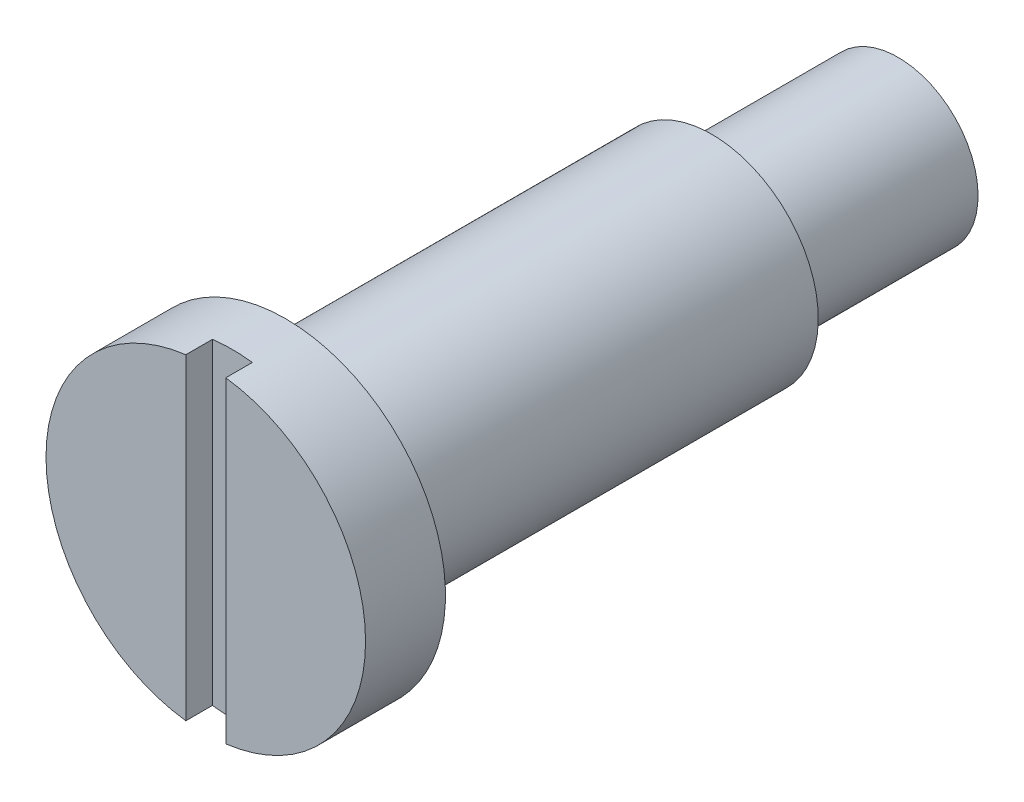
ISO-10303-21;
HEADER;
FILE_DESCRIPTION(('STEP AP214'),'2;1');
FILE_NAME('part.step','',(''),(''),'','','');
FILE_SCHEMA(('AUTOMOTIVE_DESIGN { 1 0 10303 214 1 1 1 1 }'));
ENDSEC;
DATA;
#1=APPLICATION_CONTEXT('core data for automotive mechanical design processes');
#2=APPLICATION_PROTOCOL_DEFINITION('international standard','automotive_design',2000,#1);
#3=PRODUCT_CONTEXT('',#1,'mechanical');
#4=PRODUCT('Part','Part','',(#3));
#5=PRODUCT_RELATED_PRODUCT_CATEGORY('part','',(#4));
#6=PRODUCT_DEFINITION_FORMATION('','',#4);
#7=PRODUCT_DEFINITION_CONTEXT('part definition',#1,'design');
#8=PRODUCT_DEFINITION('design','',#6,#7);
#9=PRODUCT_DEFINITION_SHAPE('','',#8);
#10=(LENGTH_UNIT() NAMED_UNIT(*) SI_UNIT(.MILLI.,.METRE.));
#11=(NAMED_UNIT(*) PLANE_ANGLE_UNIT() SI_UNIT($,.RADIAN.));
#12=(NAMED_UNIT(*) SI_UNIT($,.STERADIAN.) SOLID_ANGLE_UNIT());
#13=UNCERTAINTY_MEASURE_WITH_UNIT(LENGTH_MEASURE(1.E-05),#10,'distance_accuracy_value','');
#14=(GEOMETRIC_REPRESENTATION_CONTEXT(3) GLOBAL_UNCERTAINTY_ASSIGNED_CONTEXT((#13)) GLOBAL_UNIT_ASSIGNED_CONTEXT((#10,
#11,#12)) REPRESENTATION_CONTEXT('',''));
#15=CARTESIAN_POINT('',(0.,0.,0.));
#16=DIRECTION('',(0.,0.,1.));
#17=DIRECTION('',(1.,0.,0.));
#18=AXIS2_PLACEMENT_3D('',#15,#16,#17);
#19=CARTESIAN_POINT('',(0.,0.,0.));
#20=DIRECTION('',(0.,0.,-1.));
#21=DIRECTION('',(0.,1.,0.));
#22=AXIS2_PLACEMENT_3D('',#19,#20,#21);
#23=PLANE('',#22);
#24=CARTESIAN_POINT('',(0.,0.,0.));
#25=DIRECTION('',(0.,0.,1.));
#26=DIRECTION('',(0.,-1.,0.));
#27=AXIS2_PLACEMENT_3D('',#24,#25,#26);
#28=CIRCLE('',#27,6.);
#29=CARTESIAN_POINT('',(-0.75,5.95294044989533,0.));
#30=VERTEX_POINT('',#29);
#31=CARTESIAN_POINT('',(-0.75,-5.95294044989533,0.));
#32=VERTEX_POINT('',#31);
#33=EDGE_CURVE('E87',#30,#32,#28,.T.);
#34=ORIENTED_EDGE('',*,*,#33,.T.);
#35=DIRECTION('',(0.,-1.,0.));
#36=VECTOR('',#35,1.);
#37=CARTESIAN_POINT('',(-0.75,-6.,0.));
#38=LINE('',#37,#36);
#39=EDGE_CURVE('E81',#30,#32,#38,.T.);
#40=ORIENTED_EDGE('',*,*,#39,.F.);
#41=EDGE_LOOP('',(#34,#40));
#42=FACE_BOUND('',#41,.T.);
#43=ADVANCED_FACE('F37',(#42),#23,.F.);
#44=CARTESIAN_POINT('',(0.75,-5.95294044989533,0.));
#45=VERTEX_POINT('',#44);
#46=CARTESIAN_POINT('',(0.75,5.95294044989533,0.));
#47=VERTEX_POINT('',#46);
#48=EDGE_CURVE('E93',#45,#47,#28,.T.);
#49=ORIENTED_EDGE('',*,*,#48,.T.);
#50=DIRECTION('',(0.,1.,0.));
#51=VECTOR('',#50,1.);
#52=CARTESIAN_POINT('',(0.75,-6.,0.));
#53=LINE('',#52,#51);
#54=EDGE_CURVE('E88',#45,#47,#53,.T.);
#55=ORIENTED_EDGE('',*,*,#54,.F.);
#56=EDGE_LOOP('',(#49,#55));
#57=FACE_BOUND('',#56,.T.);
#58=ADVANCED_FACE('F39',(#57),#23,.F.);
#59=CARTESIAN_POINT('',(0.,0.,0.));
#60=DIRECTION('',(0.,0.,1.));
#61=DIRECTION('',(0.,-1.,0.));
#62=AXIS2_PLACEMENT_3D('',#59,#60,#61);
#63=CYLINDRICAL_SURFACE('',#62,6.);
#64=ORIENTED_EDGE('',*,*,#33,.F.);
#65=DIRECTION('',(0.,0.,1.));
#66=VECTOR('',#65,1.);
#67=CARTESIAN_POINT('',(-0.75,5.95294044989533,0.));
#68=LINE('',#67,#66);
#69=CARTESIAN_POINT('',(-0.75,5.95294044989533,-1.));
#70=VERTEX_POINT('',#69);
#71=EDGE_CURVE('E11',#30,#70,#68,.F.);
#72=ORIENTED_EDGE('',*,*,#71,.T.);
#73=CARTESIAN_POINT('',(0.,0.,-1.));
#74=DIRECTION('',(0.,0.,1.));
#75=DIRECTION('',(1.,0.,0.));
#76=AXIS2_PLACEMENT_3D('',#73,#74,#75);
#77=CIRCLE('',#76,6.);
#78=CARTESIAN_POINT('',(0.75,5.95294044989533,-1.));
#79=VERTEX_POINT('',#78);
#80=EDGE_CURVE('E51',#79,#70,#77,.T.);
#81=ORIENTED_EDGE('',*,*,#80,.F.);
#82=DIRECTION('',(0.,0.,1.));
#83=VECTOR('',#82,1.);
#84=CARTESIAN_POINT('',(0.75,5.95294044989533,0.));
#85=LINE('',#84,#83);
#86=EDGE_CURVE('E45',#79,#47,#85,.T.);
#87=ORIENTED_EDGE('',*,*,#86,.T.);
#88=ORIENTED_EDGE('',*,*,#48,.F.);
#89=DIRECTION('',(0.,0.,1.));
#90=VECTOR('',#89,1.);
#91=CARTESIAN_POINT('',(0.75,-5.95294044989533,0.));
#92=LINE('',#91,#90);
#93=CARTESIAN_POINT('',(0.75,-5.95294044989533,-1.));
#94=VERTEX_POINT('',#93);
#95=EDGE_CURVE('E103',#45,#94,#92,.F.);
#96=ORIENTED_EDGE('',*,*,#95,.T.);
#97=CARTESIAN_POINT('',(-0.75,-5.95294044989533,-1.));
#98=VERTEX_POINT('',#97);
#99=EDGE_CURVE('E59',#98,#94,#77,.T.);
#100=ORIENTED_EDGE('',*,*,#99,.F.);
#101=DIRECTION('',(0.,0.,1.));
#102=VECTOR('',#101,1.);
#103=CARTESIAN_POINT('',(-0.75,-5.95294044989533,0.));
#104=LINE('',#103,#102);
#105=EDGE_CURVE('E92',#98,#32,#104,.T.);
#106=ORIENTED_EDGE('',*,*,#105,.T.);
#107=EDGE_LOOP('',(#64,#72,#81,#87,#88,#96,#100,#106));
#108=FACE_BOUND('',#107,.T.);
#109=CARTESIAN_POINT('',(0.,0.,-3.));
#110=DIRECTION('',(0.,0.,1.));
#111=DIRECTION('',(0.,-1.,0.));
#112=AXIS2_PLACEMENT_3D('',#109,#110,#111);
#113=CIRCLE('',#112,6.);
#114=CARTESIAN_POINT('',(0.,-6.,-3.));
#115=VERTEX_POINT('',#114);
#116=EDGE_CURVE('E94',#115,#115,#113,.T.);
#117=ORIENTED_EDGE('',*,*,#116,.T.);
#118=EDGE_LOOP('',(#117));
#119=FACE_BOUND('',#118,.T.);
#120=ADVANCED_FACE('F90',(#108,#119),#63,.T.);
#121=CARTESIAN_POINT('',(0.,6.,-3.));
#122=DIRECTION('',(0.,0.,1.));
#123=DIRECTION('',(0.,-1.,0.));
#124=AXIS2_PLACEMENT_3D('',#121,#122,#123);
#125=PLANE('',#124);
#126=ORIENTED_EDGE('',*,*,#116,.F.);
#127=EDGE_LOOP('',(#126));
#128=FACE_BOUND('',#127,.T.);
#129=CARTESIAN_POINT('',(0.,0.,-3.));
#130=DIRECTION('',(0.,0.,1.));
#131=DIRECTION('',(0.,-1.,0.));
#132=AXIS2_PLACEMENT_3D('',#129,#130,#131);
#133=CIRCLE('',#132,4.);
#134=CARTESIAN_POINT('',(0.,-4.,-3.));
#135=VERTEX_POINT('',#134);
#136=EDGE_CURVE('E98',#135,#135,#133,.T.);
#137=ORIENTED_EDGE('',*,*,#136,.T.);
#138=EDGE_LOOP('',(#137));
#139=FACE_BOUND('',#138,.T.);
#140=ADVANCED_FACE('F125',(#128,#139),#125,.F.);
#141=CARTESIAN_POINT('',(0.,0.,0.));
#142=DIRECTION('',(0.,0.,1.));
#143=DIRECTION('',(0.,-1.,0.));
#144=AXIS2_PLACEMENT_3D('',#141,#142,#143);
#145=CYLINDRICAL_SURFACE('',#144,4.);
#146=ORIENTED_EDGE('',*,*,#136,.F.);
#147=EDGE_LOOP('',(#146));
#148=FACE_BOUND('',#147,.T.);
#149=CARTESIAN_POINT('',(0.,0.,-19.));
#150=DIRECTION('',(0.,0.,1.));
#151=DIRECTION('',(0.,-1.,0.));
#152=AXIS2_PLACEMENT_3D('',#149,#150,#151);
#153=CIRCLE('',#152,4.);
#154=CARTESIAN_POINT('',(0.,-4.,-19.));
#155=VERTEX_POINT('',#154);
#156=EDGE_CURVE('E120',#155,#155,#153,.T.);
#157=ORIENTED_EDGE('',*,*,#156,.T.);
#158=EDGE_LOOP('',(#157));
#159=FACE_BOUND('',#158,.T.);
#160=ADVANCED_FACE('F127',(#148,#159),#145,.T.);
#161=CARTESIAN_POINT('',(0.,4.,-19.));
#162=DIRECTION('',(0.,0.,1.));
#163=DIRECTION('',(0.,-1.,0.));
#164=AXIS2_PLACEMENT_3D('',#161,#162,#163);
#165=PLANE('',#164);
#166=ORIENTED_EDGE('',*,*,#156,.F.);
#167=EDGE_LOOP('',(#166));
#168=FACE_BOUND('',#167,.T.);
#169=CARTESIAN_POINT('',(0.,0.,-19.));
#170=DIRECTION('',(0.,0.,1.));
#171=DIRECTION('',(0.,-1.,0.));
#172=AXIS2_PLACEMENT_3D('',#169,#170,#171);
#173=CIRCLE('',#172,3.);
#174=CARTESIAN_POINT('',(0.,-3.,-19.));
#175=VERTEX_POINT('',#174);
#176=EDGE_CURVE('E113',#175,#175,#173,.T.);
#177=ORIENTED_EDGE('',*,*,#176,.T.);
#178=EDGE_LOOP('',(#177));
#179=FACE_BOUND('',#178,.T.);
#180=ADVANCED_FACE('F130',(#168,#179),#165,.F.);
#181=CARTESIAN_POINT('',(0.,0.,0.));
#182=DIRECTION('',(0.,0.,1.));
#183=DIRECTION('',(0.,-1.,0.));
#184=AXIS2_PLACEMENT_3D('',#181,#182,#183);
#185=CYLINDRICAL_SURFACE('',#184,3.);
#186=ORIENTED_EDGE('',*,*,#176,.F.);
#187=EDGE_LOOP('',(#186));
#188=FACE_BOUND('',#187,.T.);
#189=CARTESIAN_POINT('',(0.,0.,-26.));
#190=DIRECTION('',(0.,0.,1.));
#191=DIRECTION('',(0.,-1.,0.));
#192=AXIS2_PLACEMENT_3D('',#189,#190,#191);
#193=CIRCLE('',#192,3.);
#194=CARTESIAN_POINT('',(0.,-3.,-26.));
#195=VERTEX_POINT('',#194);
#196=EDGE_CURVE('E110',#195,#195,#193,.T.);
#197=ORIENTED_EDGE('',*,*,#196,.T.);
#198=EDGE_LOOP('',(#197));
#199=FACE_BOUND('',#198,.T.);
#200=ADVANCED_FACE('F136',(#188,#199),#185,.T.);
#201=CARTESIAN_POINT('',(0.,3.,-26.));
#202=DIRECTION('',(0.,0.,1.));
#203=DIRECTION('',(0.,-1.,0.));
#204=AXIS2_PLACEMENT_3D('',#201,#202,#203);
#205=PLANE('',#204);
#206=ORIENTED_EDGE('',*,*,#196,.F.);
#207=EDGE_LOOP('',(#206));
#208=FACE_BOUND('',#207,.T.);
#209=ADVANCED_FACE('F142',(#208),#205,.F.);
#210=CARTESIAN_POINT('',(-0.75,-6.,-1.));
#211=DIRECTION('',(-1.,0.,0.));
#212=DIRECTION('',(0.,0.,1.));
#213=AXIS2_PLACEMENT_3D('',#210,#211,#212);
#214=PLANE('',#213);
#215=DIRECTION('',(0.,-1.,0.));
#216=VECTOR('',#215,1.);
#217=CARTESIAN_POINT('',(-0.75,-6.,-1.));
#218=LINE('',#217,#216);
#219=EDGE_CURVE('E83',#70,#98,#218,.T.);
#220=ORIENTED_EDGE('',*,*,#219,.F.);
#221=ORIENTED_EDGE('',*,*,#71,.F.);
#222=ORIENTED_EDGE('',*,*,#39,.T.);
#223=ORIENTED_EDGE('',*,*,#105,.F.);
#224=EDGE_LOOP('',(#220,#221,#222,#223));
#225=FACE_BOUND('',#224,.T.);
#226=ADVANCED_FACE('F79',(#225),#214,.F.);
#227=CARTESIAN_POINT('',(0.75,-6.,-1.));
#228=DIRECTION('',(1.,0.,0.));
#229=DIRECTION('',(0.,0.,-1.));
#230=AXIS2_PLACEMENT_3D('',#227,#228,#229);
#231=PLANE('',#230);
#232=DIRECTION('',(0.,1.,0.));
#233=VECTOR('',#232,1.);
#234=CARTESIAN_POINT('',(0.75,-6.,-1.));
#235=LINE('',#234,#233);
#236=EDGE_CURVE('E108',#94,#79,#235,.T.);
#237=ORIENTED_EDGE('',*,*,#236,.F.);
#238=ORIENTED_EDGE('',*,*,#95,.F.);
#239=ORIENTED_EDGE('',*,*,#54,.T.);
#240=ORIENTED_EDGE('',*,*,#86,.F.);
#241=EDGE_LOOP('',(#237,#238,#239,#240));
#242=FACE_BOUND('',#241,.T.);
#243=ADVANCED_FACE('F151',(#242),#231,.F.);
#244=CARTESIAN_POINT('',(0.,0.,-1.));
#245=DIRECTION('',(0.,0.,1.));
#246=DIRECTION('',(1.,0.,0.));
#247=AXIS2_PLACEMENT_3D('',#244,#245,#246);
#248=PLANE('',#247);
#249=ORIENTED_EDGE('',*,*,#236,.T.);
#250=ORIENTED_EDGE('',*,*,#80,.T.);
#251=ORIENTED_EDGE('',*,*,#219,.T.);
#252=ORIENTED_EDGE('',*,*,#99,.T.);
#253=EDGE_LOOP('',(#249,#250,#251,#252));
#254=FACE_BOUND('',#253,.T.);
#255=ADVANCED_FACE('F107',(#254),#248,.T.);
#256=CLOSED_SHELL('',(#43,#58,#120,#140,#160,#180,#200,#209,#226,#243,#255));
#257=MANIFOLD_SOLID_BREP('B2',#256);
#258=ADVANCED_BREP_SHAPE_REPRESENTATION('',(#18,#257),#14);
#259=SHAPE_DEFINITION_REPRESENTATION(#9,#258);
ENDSEC;
END-ISO-10303-21;
